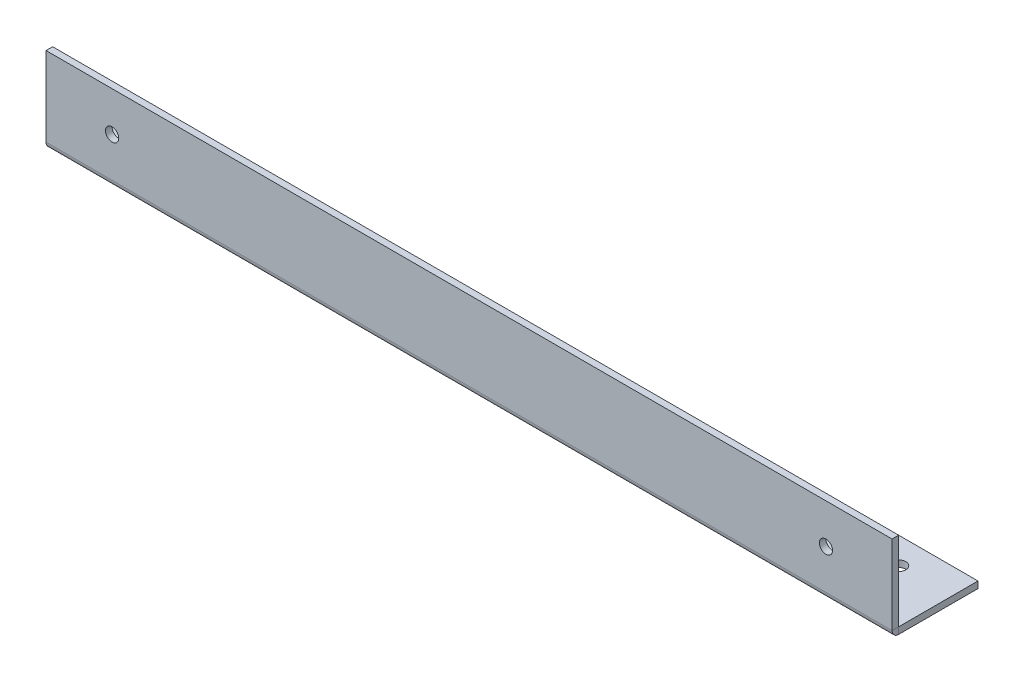
ISO-10303-21;
HEADER;
FILE_DESCRIPTION(('STEP AP214'),'2;1');
FILE_NAME('part.step','',(''),(''),'','','');
FILE_SCHEMA(('AUTOMOTIVE_DESIGN { 1 0 10303 214 1 1 1 1 }'));
ENDSEC;
DATA;
#1=APPLICATION_CONTEXT('core data for automotive mechanical design processes');
#2=APPLICATION_PROTOCOL_DEFINITION('international standard','automotive_design',2000,#1);
#3=PRODUCT_CONTEXT('',#1,'mechanical');
#4=PRODUCT('Part','Part','',(#3));
#5=PRODUCT_RELATED_PRODUCT_CATEGORY('part','',(#4));
#6=PRODUCT_DEFINITION_FORMATION('','',#4);
#7=PRODUCT_DEFINITION_CONTEXT('part definition',#1,'design');
#8=PRODUCT_DEFINITION('design','',#6,#7);
#9=PRODUCT_DEFINITION_SHAPE('','',#8);
#10=(LENGTH_UNIT() NAMED_UNIT(*) SI_UNIT(.MILLI.,.METRE.));
#11=(NAMED_UNIT(*) PLANE_ANGLE_UNIT() SI_UNIT($,.RADIAN.));
#12=(NAMED_UNIT(*) SI_UNIT($,.STERADIAN.) SOLID_ANGLE_UNIT());
#13=UNCERTAINTY_MEASURE_WITH_UNIT(LENGTH_MEASURE(1.E-05),#10,'distance_accuracy_value','');
#14=(GEOMETRIC_REPRESENTATION_CONTEXT(3) GLOBAL_UNCERTAINTY_ASSIGNED_CONTEXT((#13)) GLOBAL_UNIT_ASSIGNED_CONTEXT((#10,
#11,#12)) REPRESENTATION_CONTEXT('',''));
#15=CARTESIAN_POINT('',(0.,0.,0.));
#16=DIRECTION('',(0.,0.,1.));
#17=DIRECTION('',(1.,0.,0.));
#18=AXIS2_PLACEMENT_3D('',#15,#16,#17);
#19=CARTESIAN_POINT('',(0.,0.,0.));
#20=DIRECTION('',(-0.999999999999999,0.,0.));
#21=DIRECTION('',(0.,0.,0.999999999999999));
#22=AXIS2_PLACEMENT_3D('',#19,#20,#21);
#23=PLANE('',#22);
#24=DIRECTION('',(0.,-1.,0.));
#25=VECTOR('',#24,1.);
#26=CARTESIAN_POINT('',(0.,0.,0.));
#27=LINE('',#26,#25);
#28=CARTESIAN_POINT('',(0.,0.,0.));
#29=VERTEX_POINT('',#28);
#30=CARTESIAN_POINT('',(0.,-3.17499999999998,0.));
#31=VERTEX_POINT('',#30);
#32=EDGE_CURVE('E13',#29,#31,#27,.T.);
#33=ORIENTED_EDGE('',*,*,#32,.F.);
#34=DIRECTION('',(0.,0.,-0.999999999999999));
#35=VECTOR('',#34,1.);
#36=CARTESIAN_POINT('',(0.,0.,0.));
#37=LINE('',#36,#35);
#38=CARTESIAN_POINT('',(-1.11022302462516E-13,0.,-38.0999999999998));
#39=VERTEX_POINT('',#38);
#40=EDGE_CURVE('E159',#29,#39,#37,.T.);
#41=ORIENTED_EDGE('',*,*,#40,.T.);
#42=DIRECTION('',(0.,-1.,0.));
#43=VECTOR('',#42,1.);
#44=CARTESIAN_POINT('',(-1.11022302462516E-13,0.,-38.0999999999998));
#45=LINE('',#44,#43);
#46=CARTESIAN_POINT('',(0.,-3.17500000000001,-38.0999999999998));
#47=VERTEX_POINT('',#46);
#48=EDGE_CURVE('E156',#39,#47,#45,.T.);
#49=ORIENTED_EDGE('',*,*,#48,.T.);
#50=DIRECTION('',(0.,0.,-0.999999999999999));
#51=VECTOR('',#50,1.);
#52=CARTESIAN_POINT('',(0.,-3.17499999999998,0.));
#53=LINE('',#52,#51);
#54=EDGE_CURVE('E132',#31,#47,#53,.T.);
#55=ORIENTED_EDGE('',*,*,#54,.F.);
#56=EDGE_LOOP('',(#33,#41,#49,#55));
#57=FACE_BOUND('',#56,.T.);
#58=ADVANCED_FACE('F54',(#57),#23,.T.);
#59=CARTESIAN_POINT('',(0.,0.,0.));
#60=DIRECTION('',(-0.999999999999999,0.,0.));
#61=DIRECTION('',(0.,0.,0.999999999999999));
#62=AXIS2_PLACEMENT_3D('',#59,#60,#61);
#63=PLANE('',#62);
#64=DIRECTION('',(0.,0.,0.999999999999999));
#65=VECTOR('',#64,1.);
#66=CARTESIAN_POINT('',(0.,0.,0.));
#67=LINE('',#66,#65);
#68=CARTESIAN_POINT('',(-1.11022302462516E-13,0.,3.17500000000026));
#69=VERTEX_POINT('',#68);
#70=EDGE_CURVE('E62',#29,#69,#67,.T.);
#71=ORIENTED_EDGE('',*,*,#70,.F.);
#72=ORIENTED_EDGE('',*,*,#32,.T.);
#73=CARTESIAN_POINT('',(0.,0.,0.));
#74=DIRECTION('',(-0.999999999999999,0.,0.));
#75=DIRECTION('',(0.,0.,0.999999999999999));
#76=AXIS2_PLACEMENT_3D('',#73,#74,#75);
#77=CIRCLE('',#76,3.175);
#78=EDGE_CURVE('E177',#31,#69,#77,.T.);
#79=ORIENTED_EDGE('',*,*,#78,.T.);
#80=EDGE_LOOP('',(#71,#72,#79));
#81=FACE_BOUND('',#80,.T.);
#82=ADVANCED_FACE('F238',(#81),#63,.T.);
#83=CARTESIAN_POINT('',(406.4,0.,3.33066907387547E-13));
#84=DIRECTION('',(0.999999999999999,0.,0.));
#85=DIRECTION('',(0.,0.,-0.999999999999999));
#86=AXIS2_PLACEMENT_3D('',#83,#84,#85);
#87=PLANE('',#86);
#88=DIRECTION('',(0.,0.,0.999999999999999));
#89=VECTOR('',#88,1.);
#90=CARTESIAN_POINT('',(406.4,0.,3.33066907387547E-13));
#91=LINE('',#90,#89);
#92=CARTESIAN_POINT('',(406.4,0.,3.33066907387547E-13));
#93=VERTEX_POINT('',#92);
#94=CARTESIAN_POINT('',(406.4,0.,3.17500000000037));
#95=VERTEX_POINT('',#94);
#96=EDGE_CURVE('E70',#93,#95,#91,.T.);
#97=ORIENTED_EDGE('',*,*,#96,.F.);
#98=DIRECTION('',(0.,-1.,0.));
#99=VECTOR('',#98,1.);
#100=CARTESIAN_POINT('',(406.4,0.,3.33066907387547E-13));
#101=LINE('',#100,#99);
#102=CARTESIAN_POINT('',(406.399999999999,38.1,2.22044604925031E-13));
#103=VERTEX_POINT('',#102);
#104=EDGE_CURVE('E142',#103,#93,#101,.T.);
#105=ORIENTED_EDGE('',*,*,#104,.F.);
#106=DIRECTION('',(0.,0.,-0.999999999999999));
#107=VECTOR('',#106,1.);
#108=CARTESIAN_POINT('',(406.399999999999,38.1,3.17500000000048));
#109=LINE('',#108,#107);
#110=CARTESIAN_POINT('',(406.399999999999,38.1,3.17500000000048));
#111=VERTEX_POINT('',#110);
#112=EDGE_CURVE('E148',#111,#103,#109,.T.);
#113=ORIENTED_EDGE('',*,*,#112,.F.);
#114=DIRECTION('',(0.,1.,0.));
#115=VECTOR('',#114,1.);
#116=CARTESIAN_POINT('',(406.4,0.,3.17500000000037));
#117=LINE('',#116,#115);
#118=EDGE_CURVE('E151',#111,#95,#117,.F.);
#119=ORIENTED_EDGE('',*,*,#118,.T.);
#120=EDGE_LOOP('',(#97,#105,#113,#119));
#121=FACE_BOUND('',#120,.T.);
#122=ADVANCED_FACE('F231',(#121),#87,.T.);
#123=CARTESIAN_POINT('',(406.4,0.,3.33066907387547E-13));
#124=DIRECTION('',(0.999999999999999,0.,0.));
#125=DIRECTION('',(0.,0.,-0.999999999999999));
#126=AXIS2_PLACEMENT_3D('',#123,#124,#125);
#127=PLANE('',#126);
#128=DIRECTION('',(0.,-1.,0.));
#129=VECTOR('',#128,1.);
#130=CARTESIAN_POINT('',(406.4,0.,3.33066907387547E-13));
#131=LINE('',#130,#129);
#132=CARTESIAN_POINT('',(406.4,-3.17499999999998,2.22044604925031E-13));
#133=VERTEX_POINT('',#132);
#134=EDGE_CURVE('E122',#93,#133,#131,.T.);
#135=ORIENTED_EDGE('',*,*,#134,.F.);
#136=ORIENTED_EDGE('',*,*,#96,.T.);
#137=CARTESIAN_POINT('',(406.4,0.,3.33066907387547E-13));
#138=DIRECTION('',(-0.999999999999999,0.,0.));
#139=DIRECTION('',(0.,0.,0.999999999999999));
#140=AXIS2_PLACEMENT_3D('',#137,#138,#139);
#141=CIRCLE('',#140,3.175);
#142=EDGE_CURVE('E181',#95,#133,#141,.F.);
#143=ORIENTED_EDGE('',*,*,#142,.T.);
#144=EDGE_LOOP('',(#135,#136,#143));
#145=FACE_BOUND('',#144,.T.);
#146=ADVANCED_FACE('F233',(#145),#127,.T.);
#147=CARTESIAN_POINT('',(406.4,-3.17499999999998,2.22044604925031E-13));
#148=DIRECTION('',(0.,1.,0.));
#149=DIRECTION('',(0.,0.,0.999999999999999));
#150=AXIS2_PLACEMENT_3D('',#147,#148,#149);
#151=PLANE('',#150);
#152=CARTESIAN_POINT('',(25.3999999999999,-3.17500000000001,-25.3999999999998));
#153=DIRECTION('',(0.,-1.,0.));
#154=DIRECTION('',(0.,0.,-0.999999999999999));
#155=AXIS2_PLACEMENT_3D('',#152,#153,#154);
#156=CIRCLE('',#155,3.429);
#157=CARTESIAN_POINT('',(25.3999999999999,-3.17500000000001,-28.8289999999998));
#158=VERTEX_POINT('',#157);
#159=EDGE_CURVE('E187',#158,#158,#156,.T.);
#160=ORIENTED_EDGE('',*,*,#159,.F.);
#161=EDGE_LOOP('',(#160));
#162=FACE_BOUND('',#161,.T.);
#163=CARTESIAN_POINT('',(381.,-3.17499999999998,-25.4));
#164=DIRECTION('',(0.,-1.,0.));
#165=DIRECTION('',(0.,0.,-0.999999999999999));
#166=AXIS2_PLACEMENT_3D('',#163,#164,#165);
#167=CIRCLE('',#166,3.429);
#168=CARTESIAN_POINT('',(381.,-3.17499999999998,-28.829));
#169=VERTEX_POINT('',#168);
#170=EDGE_CURVE('E193',#169,#169,#167,.T.);
#171=ORIENTED_EDGE('',*,*,#170,.F.);
#172=EDGE_LOOP('',(#171));
#173=FACE_BOUND('',#172,.T.);
#174=DIRECTION('',(0.,0.,-0.999999999999999));
#175=VECTOR('',#174,1.);
#176=CARTESIAN_POINT('',(406.4,-3.17499999999998,2.22044604925031E-13));
#177=LINE('',#176,#175);
#178=CARTESIAN_POINT('',(406.4,-3.17499999999996,-38.0999999999999));
#179=VERTEX_POINT('',#178);
#180=EDGE_CURVE('E115',#133,#179,#177,.T.);
#181=ORIENTED_EDGE('',*,*,#180,.F.);
#182=DIRECTION('',(-0.999999999999999,0.,0.));
#183=VECTOR('',#182,1.);
#184=CARTESIAN_POINT('',(406.4,-3.17499999999998,2.22044604925031E-13));
#185=LINE('',#184,#183);
#186=EDGE_CURVE('E136',#133,#31,#185,.T.);
#187=ORIENTED_EDGE('',*,*,#186,.T.);
#188=ORIENTED_EDGE('',*,*,#54,.T.);
#189=DIRECTION('',(-0.999999999999999,0.,0.));
#190=VECTOR('',#189,1.);
#191=CARTESIAN_POINT('',(406.4,-3.17499999999996,-38.0999999999999));
#192=LINE('',#191,#190);
#193=EDGE_CURVE('E129',#179,#47,#192,.T.);
#194=ORIENTED_EDGE('',*,*,#193,.F.);
#195=EDGE_LOOP('',(#181,#187,#188,#194));
#196=FACE_BOUND('',#195,.T.);
#197=ADVANCED_FACE('F130',(#162,#173,#196),#151,.F.);
#198=CARTESIAN_POINT('',(406.4,0.,-38.0999999999997));
#199=DIRECTION('',(0.,0.,-0.999999999999999));
#200=DIRECTION('',(-0.999999999999999,0.,0.));
#201=AXIS2_PLACEMENT_3D('',#198,#199,#200);
#202=PLANE('',#201);
#203=ORIENTED_EDGE('',*,*,#48,.F.);
#204=DIRECTION('',(-0.999999999999999,0.,0.));
#205=VECTOR('',#204,1.);
#206=CARTESIAN_POINT('',(406.4,0.,-38.0999999999997));
#207=LINE('',#206,#205);
#208=CARTESIAN_POINT('',(406.4,0.,-38.0999999999997));
#209=VERTEX_POINT('',#208);
#210=EDGE_CURVE('E137',#209,#39,#207,.T.);
#211=ORIENTED_EDGE('',*,*,#210,.F.);
#212=DIRECTION('',(0.,-1.,0.));
#213=VECTOR('',#212,1.);
#214=CARTESIAN_POINT('',(406.4,0.,-38.0999999999997));
#215=LINE('',#214,#213);
#216=EDGE_CURVE('E120',#209,#179,#215,.T.);
#217=ORIENTED_EDGE('',*,*,#216,.T.);
#218=ORIENTED_EDGE('',*,*,#193,.T.);
#219=EDGE_LOOP('',(#203,#211,#217,#218));
#220=FACE_BOUND('',#219,.T.);
#221=ADVANCED_FACE('F139',(#220),#202,.T.);
#222=CARTESIAN_POINT('',(406.4,0.,3.33066907387547E-13));
#223=DIRECTION('',(0.,1.,0.));
#224=DIRECTION('',(0.,0.,0.999999999999999));
#225=AXIS2_PLACEMENT_3D('',#222,#223,#224);
#226=PLANE('',#225);
#227=CARTESIAN_POINT('',(25.3999999999998,0.,-25.3999999999998));
#228=DIRECTION('',(0.,1.,0.));
#229=DIRECTION('',(0.,0.,0.999999999999999));
#230=AXIS2_PLACEMENT_3D('',#227,#228,#229);
#231=CIRCLE('',#230,3.429);
#232=CARTESIAN_POINT('',(25.3999999999998,0.,-21.9709999999998));
#233=VERTEX_POINT('',#232);
#234=EDGE_CURVE('E57',#233,#233,#231,.T.);
#235=ORIENTED_EDGE('',*,*,#234,.F.);
#236=EDGE_LOOP('',(#235));
#237=FACE_BOUND('',#236,.T.);
#238=CARTESIAN_POINT('',(381.,0.,-25.3999999999998));
#239=DIRECTION('',(0.,1.,0.));
#240=DIRECTION('',(0.,0.,0.999999999999999));
#241=AXIS2_PLACEMENT_3D('',#238,#239,#240);
#242=CIRCLE('',#241,3.429);
#243=CARTESIAN_POINT('',(381.,0.,-21.9709999999998));
#244=VERTEX_POINT('',#243);
#245=EDGE_CURVE('E185',#244,#244,#242,.T.);
#246=ORIENTED_EDGE('',*,*,#245,.F.);
#247=EDGE_LOOP('',(#246));
#248=FACE_BOUND('',#247,.T.);
#249=ORIENTED_EDGE('',*,*,#40,.F.);
#250=DIRECTION('',(-0.999999999999999,0.,0.));
#251=VECTOR('',#250,1.);
#252=CARTESIAN_POINT('',(406.4,0.,3.33066907387547E-13));
#253=LINE('',#252,#251);
#254=EDGE_CURVE('E172',#93,#29,#253,.T.);
#255=ORIENTED_EDGE('',*,*,#254,.F.);
#256=DIRECTION('',(0.,0.,-0.999999999999999));
#257=VECTOR('',#256,1.);
#258=CARTESIAN_POINT('',(406.4,0.,3.33066907387547E-13));
#259=LINE('',#258,#257);
#260=EDGE_CURVE('E140',#93,#209,#259,.T.);
#261=ORIENTED_EDGE('',*,*,#260,.T.);
#262=ORIENTED_EDGE('',*,*,#210,.T.);
#263=EDGE_LOOP('',(#249,#255,#261,#262));
#264=FACE_BOUND('',#263,.T.);
#265=ADVANCED_FACE('F217',(#237,#248,#264),#226,.T.);
#266=CARTESIAN_POINT('',(406.4,0.,3.33066907387547E-13));
#267=DIRECTION('',(0.,0.,-0.999999999999999));
#268=DIRECTION('',(-0.999999999999999,0.,0.));
#269=AXIS2_PLACEMENT_3D('',#266,#267,#268);
#270=PLANE('',#269);
#271=CARTESIAN_POINT('',(31.7499999999999,19.0499999999999,0.));
#272=DIRECTION('',(0.,0.,-0.999999999999999));
#273=DIRECTION('',(-0.999999999999999,0.,0.));
#274=AXIS2_PLACEMENT_3D('',#271,#272,#273);
#275=CIRCLE('',#274,3.17499999999998);
#276=CARTESIAN_POINT('',(28.5749999999999,19.0499999999999,0.));
#277=VERTEX_POINT('',#276);
#278=EDGE_CURVE('E157',#277,#277,#275,.T.);
#279=ORIENTED_EDGE('',*,*,#278,.F.);
#280=EDGE_LOOP('',(#279));
#281=FACE_BOUND('',#280,.T.);
#282=CARTESIAN_POINT('',(374.65,19.05,2.22044604925031E-13));
#283=DIRECTION('',(0.,0.,-0.999999999999999));
#284=DIRECTION('',(-0.999999999999999,0.,0.));
#285=AXIS2_PLACEMENT_3D('',#282,#283,#284);
#286=CIRCLE('',#285,3.17499999999997);
#287=CARTESIAN_POINT('',(371.475,19.05,2.22044604925031E-13));
#288=VERTEX_POINT('',#287);
#289=EDGE_CURVE('E203',#288,#288,#286,.T.);
#290=ORIENTED_EDGE('',*,*,#289,.F.);
#291=EDGE_LOOP('',(#290));
#292=FACE_BOUND('',#291,.T.);
#293=DIRECTION('',(0.,-1.,0.));
#294=VECTOR('',#293,1.);
#295=CARTESIAN_POINT('',(0.,0.,0.));
#296=LINE('',#295,#294);
#297=CARTESIAN_POINT('',(-1.11022302462516E-13,38.1,0.));
#298=VERTEX_POINT('',#297);
#299=EDGE_CURVE('E162',#298,#29,#296,.T.);
#300=ORIENTED_EDGE('',*,*,#299,.F.);
#301=DIRECTION('',(-0.999999999999999,0.,0.));
#302=VECTOR('',#301,1.);
#303=CARTESIAN_POINT('',(406.399999999999,38.1,2.22044604925031E-13));
#304=LINE('',#303,#302);
#305=EDGE_CURVE('E170',#103,#298,#304,.T.);
#306=ORIENTED_EDGE('',*,*,#305,.F.);
#307=ORIENTED_EDGE('',*,*,#104,.T.);
#308=ORIENTED_EDGE('',*,*,#254,.T.);
#309=EDGE_LOOP('',(#300,#306,#307,#308));
#310=FACE_BOUND('',#309,.T.);
#311=ADVANCED_FACE('F213',(#281,#292,#310),#270,.T.);
#312=CARTESIAN_POINT('',(406.399999999999,38.1,3.17500000000048));
#313=DIRECTION('',(0.,1.,0.));
#314=DIRECTION('',(0.,0.,0.999999999999999));
#315=AXIS2_PLACEMENT_3D('',#312,#313,#314);
#316=PLANE('',#315);
#317=DIRECTION('',(0.,0.,-0.999999999999999));
#318=VECTOR('',#317,1.);
#319=CARTESIAN_POINT('',(-1.11022302462516E-13,38.1,3.17500000000004));
#320=LINE('',#319,#318);
#321=CARTESIAN_POINT('',(-1.11022302462516E-13,38.1,3.17500000000004));
#322=VERTEX_POINT('',#321);
#323=EDGE_CURVE('E164',#322,#298,#320,.T.);
#324=ORIENTED_EDGE('',*,*,#323,.F.);
#325=DIRECTION('',(-0.999999999999999,0.,0.));
#326=VECTOR('',#325,1.);
#327=CARTESIAN_POINT('',(406.399999999999,38.1,3.17500000000048));
#328=LINE('',#327,#326);
#329=EDGE_CURVE('E154',#111,#322,#328,.T.);
#330=ORIENTED_EDGE('',*,*,#329,.F.);
#331=ORIENTED_EDGE('',*,*,#112,.T.);
#332=ORIENTED_EDGE('',*,*,#305,.T.);
#333=EDGE_LOOP('',(#324,#330,#331,#332));
#334=FACE_BOUND('',#333,.T.);
#335=ADVANCED_FACE('F216',(#334),#316,.T.);
#336=CARTESIAN_POINT('',(406.4,0.,3.17500000000037));
#337=DIRECTION('',(0.,0.,-0.999999999999999));
#338=DIRECTION('',(-0.999999999999999,0.,0.));
#339=AXIS2_PLACEMENT_3D('',#336,#337,#338);
#340=PLANE('',#339);
#341=CARTESIAN_POINT('',(31.7499999999999,19.05,3.17500000000026));
#342=DIRECTION('',(0.,0.,0.999999999999999));
#343=DIRECTION('',(0.999999999999999,0.,0.));
#344=AXIS2_PLACEMENT_3D('',#341,#342,#343);
#345=CIRCLE('',#344,3.17499999999998);
#346=CARTESIAN_POINT('',(34.9249999999998,19.05,3.17500000000026));
#347=VERTEX_POINT('',#346);
#348=EDGE_CURVE('E200',#347,#347,#345,.T.);
#349=ORIENTED_EDGE('',*,*,#348,.F.);
#350=EDGE_LOOP('',(#349));
#351=FACE_BOUND('',#350,.T.);
#352=CARTESIAN_POINT('',(374.65,19.05,3.17500000000037));
#353=DIRECTION('',(0.,0.,0.999999999999999));
#354=DIRECTION('',(0.999999999999999,0.,0.));
#355=AXIS2_PLACEMENT_3D('',#352,#353,#354);
#356=CIRCLE('',#355,3.17499999999997);
#357=CARTESIAN_POINT('',(377.825,19.05,3.17500000000037));
#358=VERTEX_POINT('',#357);
#359=EDGE_CURVE('E191',#358,#358,#356,.T.);
#360=ORIENTED_EDGE('',*,*,#359,.F.);
#361=EDGE_LOOP('',(#360));
#362=FACE_BOUND('',#361,.T.);
#363=DIRECTION('',(0.,1.,0.));
#364=VECTOR('',#363,1.);
#365=CARTESIAN_POINT('',(-1.11022302462516E-13,0.,3.17500000000026));
#366=LINE('',#365,#364);
#367=EDGE_CURVE('E126',#322,#69,#366,.F.);
#368=ORIENTED_EDGE('',*,*,#367,.T.);
#369=DIRECTION('',(-0.999999999999999,0.,0.));
#370=VECTOR('',#369,1.);
#371=CARTESIAN_POINT('',(406.4,0.,3.17500000000037));
#372=LINE('',#371,#370);
#373=EDGE_CURVE('E179',#69,#95,#372,.F.);
#374=ORIENTED_EDGE('',*,*,#373,.T.);
#375=ORIENTED_EDGE('',*,*,#118,.F.);
#376=ORIENTED_EDGE('',*,*,#329,.T.);
#377=EDGE_LOOP('',(#368,#374,#375,#376));
#378=FACE_BOUND('',#377,.T.);
#379=ADVANCED_FACE('F242',(#351,#362,#378),#340,.F.);
#380=CARTESIAN_POINT('',(406.4,0.,3.33066907387547E-13));
#381=DIRECTION('',(-0.999999999999999,0.,0.));
#382=DIRECTION('',(0.,0.,0.999999999999999));
#383=AXIS2_PLACEMENT_3D('',#380,#381,#382);
#384=PLANE('',#383);
#385=ORIENTED_EDGE('',*,*,#260,.F.);
#386=ORIENTED_EDGE('',*,*,#134,.T.);
#387=ORIENTED_EDGE('',*,*,#180,.T.);
#388=ORIENTED_EDGE('',*,*,#216,.F.);
#389=EDGE_LOOP('',(#385,#386,#387,#388));
#390=FACE_BOUND('',#389,.T.);
#391=ADVANCED_FACE('F118',(#390),#384,.F.);
#392=CARTESIAN_POINT('',(0.,0.,0.));
#393=DIRECTION('',(-0.999999999999999,0.,0.));
#394=DIRECTION('',(0.,0.,0.999999999999999));
#395=AXIS2_PLACEMENT_3D('',#392,#393,#394);
#396=PLANE('',#395);
#397=ORIENTED_EDGE('',*,*,#299,.T.);
#398=ORIENTED_EDGE('',*,*,#70,.T.);
#399=ORIENTED_EDGE('',*,*,#367,.F.);
#400=ORIENTED_EDGE('',*,*,#323,.T.);
#401=EDGE_LOOP('',(#397,#398,#399,#400));
#402=FACE_BOUND('',#401,.T.);
#403=ADVANCED_FACE('F226',(#402),#396,.T.);
#404=CARTESIAN_POINT('',(406.4,0.,3.33066907387547E-13));
#405=DIRECTION('',(-0.999999999999999,0.,0.));
#406=DIRECTION('',(0.,0.,0.999999999999999));
#407=AXIS2_PLACEMENT_3D('',#404,#405,#406);
#408=CYLINDRICAL_SURFACE('',#407,3.175);
#409=ORIENTED_EDGE('',*,*,#142,.F.);
#410=ORIENTED_EDGE('',*,*,#373,.F.);
#411=ORIENTED_EDGE('',*,*,#78,.F.);
#412=ORIENTED_EDGE('',*,*,#186,.F.);
#413=EDGE_LOOP('',(#409,#410,#411,#412));
#414=FACE_BOUND('',#413,.T.);
#415=ADVANCED_FACE('F243',(#414),#408,.T.);
#416=CARTESIAN_POINT('',(374.65,19.05,-3.17499999999982));
#417=DIRECTION('',(0.,0.,0.999999999999999));
#418=DIRECTION('',(0.999999999999999,0.,0.));
#419=AXIS2_PLACEMENT_3D('',#416,#417,#418);
#420=CYLINDRICAL_SURFACE('',#419,3.17499999999997);
#421=ORIENTED_EDGE('',*,*,#289,.T.);
#422=EDGE_LOOP('',(#421));
#423=FACE_BOUND('',#422,.T.);
#424=ORIENTED_EDGE('',*,*,#359,.T.);
#425=EDGE_LOOP('',(#424));
#426=FACE_BOUND('',#425,.T.);
#427=ADVANCED_FACE('F245',(#423,#426),#420,.F.);
#428=CARTESIAN_POINT('',(31.7499999999999,19.0499999999999,-3.17499999999993));
#429=DIRECTION('',(0.,0.,0.999999999999999));
#430=DIRECTION('',(0.999999999999999,0.,0.));
#431=AXIS2_PLACEMENT_3D('',#428,#429,#430);
#432=CYLINDRICAL_SURFACE('',#431,3.17499999999998);
#433=ORIENTED_EDGE('',*,*,#278,.T.);
#434=EDGE_LOOP('',(#433));
#435=FACE_BOUND('',#434,.T.);
#436=ORIENTED_EDGE('',*,*,#348,.T.);
#437=EDGE_LOOP('',(#436));
#438=FACE_BOUND('',#437,.T.);
#439=ADVANCED_FACE('F210',(#435,#438),#432,.F.);
#440=CARTESIAN_POINT('',(381.,3.17499999999998,-25.3999999999998));
#441=DIRECTION('',(0.,-1.,0.));
#442=DIRECTION('',(0.,0.,-0.999999999999999));
#443=AXIS2_PLACEMENT_3D('',#440,#441,#442);
#444=CYLINDRICAL_SURFACE('',#443,3.429);
#445=ORIENTED_EDGE('',*,*,#245,.T.);
#446=EDGE_LOOP('',(#445));
#447=FACE_BOUND('',#446,.T.);
#448=ORIENTED_EDGE('',*,*,#170,.T.);
#449=EDGE_LOOP('',(#448));
#450=FACE_BOUND('',#449,.T.);
#451=ADVANCED_FACE('F287',(#447,#450),#444,.F.);
#452=CARTESIAN_POINT('',(25.3999999999999,3.17500000000004,-25.3999999999998));
#453=DIRECTION('',(0.,-1.,0.));
#454=DIRECTION('',(0.,0.,-0.999999999999999));
#455=AXIS2_PLACEMENT_3D('',#452,#453,#454);
#456=CYLINDRICAL_SURFACE('',#455,3.429);
#457=ORIENTED_EDGE('',*,*,#234,.T.);
#458=EDGE_LOOP('',(#457));
#459=FACE_BOUND('',#458,.T.);
#460=ORIENTED_EDGE('',*,*,#159,.T.);
#461=EDGE_LOOP('',(#460));
#462=FACE_BOUND('',#461,.T.);
#463=ADVANCED_FACE('F290',(#459,#462),#456,.F.);
#464=CLOSED_SHELL('',(#58,#82,#122,#146,#197,#221,#265,#311,#335,#379,#391,#403,#415,#427,#439,
#451,#463));
#465=MANIFOLD_SOLID_BREP('B2',#464);
#466=ADVANCED_BREP_SHAPE_REPRESENTATION('',(#18,#465),#14);
#467=SHAPE_DEFINITION_REPRESENTATION(#9,#466);
ENDSEC;
END-ISO-10303-21;
